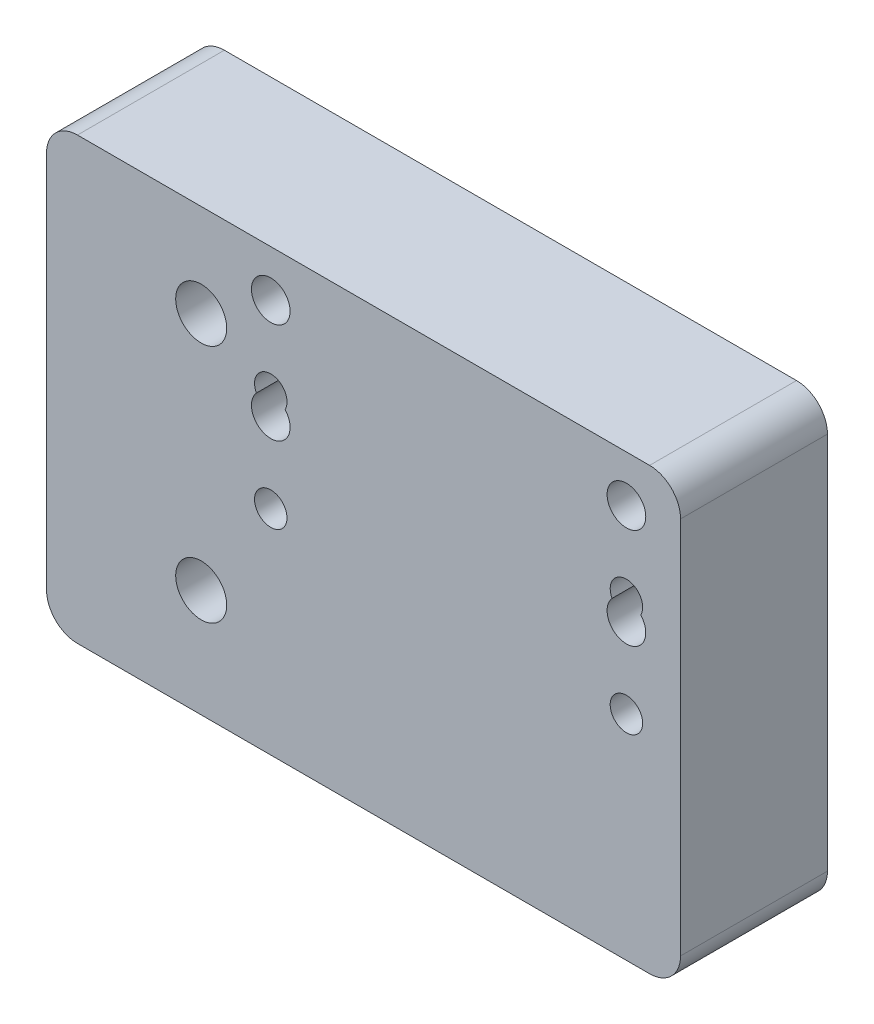
ISO-10303-21;
HEADER;
FILE_DESCRIPTION(('STEP AP214'),'2;1');
FILE_NAME('part.step','',(''),(''),'','','');
FILE_SCHEMA(('AUTOMOTIVE_DESIGN { 1 0 10303 214 1 1 1 1 }'));
ENDSEC;
DATA;
#1=APPLICATION_CONTEXT('core data for automotive mechanical design processes');
#2=APPLICATION_PROTOCOL_DEFINITION('international standard','automotive_design',2000,#1);
#3=PRODUCT_CONTEXT('',#1,'mechanical');
#4=PRODUCT('Part','Part','',(#3));
#5=PRODUCT_RELATED_PRODUCT_CATEGORY('part','',(#4));
#6=PRODUCT_DEFINITION_FORMATION('','',#4);
#7=PRODUCT_DEFINITION_CONTEXT('part definition',#1,'design');
#8=PRODUCT_DEFINITION('design','',#6,#7);
#9=PRODUCT_DEFINITION_SHAPE('','',#8);
#10=(LENGTH_UNIT() NAMED_UNIT(*) SI_UNIT(.MILLI.,.METRE.));
#11=(NAMED_UNIT(*) PLANE_ANGLE_UNIT() SI_UNIT($,.RADIAN.));
#12=(NAMED_UNIT(*) SI_UNIT($,.STERADIAN.) SOLID_ANGLE_UNIT());
#13=UNCERTAINTY_MEASURE_WITH_UNIT(LENGTH_MEASURE(1.E-05),#10,'distance_accuracy_value','');
#14=(GEOMETRIC_REPRESENTATION_CONTEXT(3) GLOBAL_UNCERTAINTY_ASSIGNED_CONTEXT((#13)) GLOBAL_UNIT_ASSIGNED_CONTEXT((#10,
#11,#12)) REPRESENTATION_CONTEXT('',''));
#15=CARTESIAN_POINT('',(0.,0.,0.));
#16=DIRECTION('',(0.,0.,1.));
#17=DIRECTION('',(1.,0.,0.));
#18=AXIS2_PLACEMENT_3D('',#15,#16,#17);
#19=CARTESIAN_POINT('',(0.,0.,0.));
#20=DIRECTION('',(0.,0.,-1.));
#21=DIRECTION('',(-1.,0.,0.));
#22=AXIS2_PLACEMENT_3D('',#19,#20,#21);
#23=PLANE('',#22);
#24=CARTESIAN_POINT('',(8.99999999813458,58.7452487765764,0.));
#25=DIRECTION('',(0.,0.,1.));
#26=DIRECTION('',(1.,0.,0.));
#27=AXIS2_PLACEMENT_3D('',#24,#25,#26);
#28=CIRCLE('',#27,2.5);
#29=CARTESIAN_POINT('',(11.4999999981346,58.7452487765764,0.));
#30=VERTEX_POINT('',#29);
#31=EDGE_CURVE('E143',#30,#30,#28,.T.);
#32=ORIENTED_EDGE('',*,*,#31,.T.);
#33=EDGE_LOOP('',(#32));
#34=FACE_BOUND('',#33,.T.);
#35=CARTESIAN_POINT('',(54.9999999981346,58.7452487765762,0.));
#36=DIRECTION('',(0.,0.,1.));
#37=DIRECTION('',(1.,0.,0.));
#38=AXIS2_PLACEMENT_3D('',#35,#36,#37);
#39=CIRCLE('',#38,2.5);
#40=CARTESIAN_POINT('',(57.4999999981346,58.7452487765762,0.));
#41=VERTEX_POINT('',#40);
#42=EDGE_CURVE('E256',#41,#41,#39,.T.);
#43=ORIENTED_EDGE('',*,*,#42,.T.);
#44=EDGE_LOOP('',(#43));
#45=FACE_BOUND('',#44,.T.);
#46=CARTESIAN_POINT('',(0.,52.7452487765018,0.));
#47=DIRECTION('',(0.,0.,-1.));
#48=DIRECTION('',(-1.,0.,0.));
#49=AXIS2_PLACEMENT_3D('',#46,#47,#48);
#50=CIRCLE('',#49,6.3);
#51=CARTESIAN_POINT('',(-6.3,52.7452487765018,0.));
#52=VERTEX_POINT('',#51);
#53=EDGE_CURVE('E244',#52,#52,#50,.T.);
#54=ORIENTED_EDGE('',*,*,#53,.F.);
#55=EDGE_LOOP('',(#54));
#56=FACE_BOUND('',#55,.T.);
#57=CARTESIAN_POINT('',(0.,21.7452487765018,0.));
#58=DIRECTION('',(0.,0.,-1.));
#59=DIRECTION('',(-1.,0.,0.));
#60=AXIS2_PLACEMENT_3D('',#57,#58,#59);
#61=CIRCLE('',#60,6.3);
#62=CARTESIAN_POINT('',(-6.3,21.7452487765018,0.));
#63=VERTEX_POINT('',#62);
#64=EDGE_CURVE('E233',#63,#63,#61,.T.);
#65=ORIENTED_EDGE('',*,*,#64,.F.);
#66=EDGE_LOOP('',(#65));
#67=FACE_BOUND('',#66,.T.);
#68=DIRECTION('',(-1.,0.,0.));
#69=VECTOR('',#68,1.);
#70=CARTESIAN_POINT('',(61.9999999981127,7.79524877651672,0.));
#71=LINE('',#70,#69);
#72=CARTESIAN_POINT('',(57.9999999981127,7.79524877651672,0.));
#73=VERTEX_POINT('',#72);
#74=CARTESIAN_POINT('',(-15.9999999999999,7.79524877651672,0.));
#75=VERTEX_POINT('',#74);
#76=EDGE_CURVE('E223',#73,#75,#71,.T.);
#77=ORIENTED_EDGE('',*,*,#76,.T.);
#78=CARTESIAN_POINT('',(-15.9999999999999,11.7952487765167,0.));
#79=DIRECTION('',(0.,0.,-1.));
#80=DIRECTION('',(-1.,0.,0.));
#81=AXIS2_PLACEMENT_3D('',#78,#79,#80);
#82=CIRCLE('',#81,4.);
#83=CARTESIAN_POINT('',(-19.9999999999999,11.7952487765167,0.));
#84=VERTEX_POINT('',#83);
#85=EDGE_CURVE('E172',#75,#84,#82,.T.);
#86=ORIENTED_EDGE('',*,*,#85,.T.);
#87=DIRECTION('',(0.,-1.,0.));
#88=VECTOR('',#87,1.);
#89=CARTESIAN_POINT('',(-19.9999999999999,68.7452487765018,0.));
#90=LINE('',#89,#88);
#91=CARTESIAN_POINT('',(-19.9999999999999,60.7452487765021,0.));
#92=VERTEX_POINT('',#91);
#93=EDGE_CURVE('E154',#92,#84,#90,.T.);
#94=ORIENTED_EDGE('',*,*,#93,.F.);
#95=CARTESIAN_POINT('',(-15.9999999999999,60.7452487765021,0.));
#96=DIRECTION('',(0.,0.,-1.));
#97=DIRECTION('',(-1.,0.,0.));
#98=AXIS2_PLACEMENT_3D('',#95,#96,#97);
#99=CIRCLE('',#98,4.);
#100=CARTESIAN_POINT('',(-15.9999999999999,64.7452487765022,0.));
#101=VERTEX_POINT('',#100);
#102=EDGE_CURVE('E168',#92,#101,#99,.T.);
#103=ORIENTED_EDGE('',*,*,#102,.T.);
#104=DIRECTION('',(-1.,0.,0.));
#105=VECTOR('',#104,1.);
#106=CARTESIAN_POINT('',(-19.9999999999999,64.7452487765022,0.));
#107=LINE('',#106,#105);
#108=CARTESIAN_POINT('',(57.9999999981127,64.7452487765022,0.));
#109=VERTEX_POINT('',#108);
#110=EDGE_CURVE('E227',#109,#101,#107,.T.);
#111=ORIENTED_EDGE('',*,*,#110,.F.);
#112=CARTESIAN_POINT('',(57.9999999981127,60.7452487765021,0.));
#113=DIRECTION('',(0.,0.,-1.));
#114=DIRECTION('',(-1.,0.,0.));
#115=AXIS2_PLACEMENT_3D('',#112,#113,#114);
#116=CIRCLE('',#115,4.);
#117=CARTESIAN_POINT('',(61.9999999981127,60.7452487765021,0.));
#118=VERTEX_POINT('',#117);
#119=EDGE_CURVE('E166',#109,#118,#116,.T.);
#120=ORIENTED_EDGE('',*,*,#119,.T.);
#121=DIRECTION('',(0.,1.,0.));
#122=VECTOR('',#121,1.);
#123=CARTESIAN_POINT('',(61.9999999981127,68.7452487765019,0.));
#124=LINE('',#123,#122);
#125=CARTESIAN_POINT('',(61.9999999981127,11.7952487765167,0.));
#126=VERTEX_POINT('',#125);
#127=EDGE_CURVE('E149',#126,#118,#124,.T.);
#128=ORIENTED_EDGE('',*,*,#127,.F.);
#129=CARTESIAN_POINT('',(57.9999999981127,11.7952487765167,0.));
#130=DIRECTION('',(0.,0.,-1.));
#131=DIRECTION('',(-1.,0.,0.));
#132=AXIS2_PLACEMENT_3D('',#129,#130,#131);
#133=CIRCLE('',#132,4.);
#134=EDGE_CURVE('E170',#126,#73,#133,.T.);
#135=ORIENTED_EDGE('',*,*,#134,.T.);
#136=EDGE_LOOP('',(#77,#86,#94,#103,#111,#120,#128,#135));
#137=FACE_BOUND('',#136,.T.);
#138=CARTESIAN_POINT('',(8.99999999811648,48.3952487774818,0.));
#139=DIRECTION('',(0.,0.,1.));
#140=DIRECTION('',(1.,0.,0.));
#141=AXIS2_PLACEMENT_3D('',#138,#139,#140);
#142=CIRCLE('',#141,2.1);
#143=CARTESIAN_POINT('',(10.8584531508509,47.4174185881896,0.));
#144=VERTEX_POINT('',#143);
#145=CARTESIAN_POINT('',(7.14154684538737,47.4174185881794,0.));
#146=VERTEX_POINT('',#145);
#147=EDGE_CURVE('E57',#144,#146,#142,.T.);
#148=ORIENTED_EDGE('',*,*,#147,.T.);
#149=CARTESIAN_POINT('',(8.99999999812373,45.7452487765023,0.));
#150=DIRECTION('',(0.,0.,1.));
#151=DIRECTION('',(1.,0.,0.));
#152=AXIS2_PLACEMENT_3D('',#149,#150,#151);
#153=CIRCLE('',#152,2.5);
#154=EDGE_CURVE('E141',#146,#144,#153,.T.);
#155=ORIENTED_EDGE('',*,*,#154,.T.);
#156=EDGE_LOOP('',(#148,#155));
#157=FACE_BOUND('',#156,.T.);
#158=CARTESIAN_POINT('',(8.99999999812887,35.3952487774845,0.));
#159=DIRECTION('',(0.,0.,1.));
#160=DIRECTION('',(1.,0.,0.));
#161=AXIS2_PLACEMENT_3D('',#158,#159,#160);
#162=CIRCLE('',#161,2.1);
#163=CARTESIAN_POINT('',(11.0999999981289,35.3952487774845,0.));
#164=VERTEX_POINT('',#163);
#165=EDGE_CURVE('E210',#164,#164,#162,.T.);
#166=ORIENTED_EDGE('',*,*,#165,.T.);
#167=EDGE_LOOP('',(#166));
#168=FACE_BOUND('',#167,.T.);
#169=CARTESIAN_POINT('',(54.9999999981288,48.3952487774845,0.));
#170=DIRECTION('',(0.,0.,1.));
#171=DIRECTION('',(1.,0.,0.));
#172=AXIS2_PLACEMENT_3D('',#169,#170,#171);
#173=CIRCLE('',#172,2.1);
#174=CARTESIAN_POINT('',(56.8584531508578,47.4174185881818,0.));
#175=VERTEX_POINT('',#174);
#176=CARTESIAN_POINT('',(53.1415468453961,47.4174185881889,0.));
#177=VERTEX_POINT('',#176);
#178=EDGE_CURVE('E49',#175,#177,#173,.T.);
#179=ORIENTED_EDGE('',*,*,#178,.T.);
#180=CARTESIAN_POINT('',(54.9999999981237,45.7452487765022,0.));
#181=DIRECTION('',(0.,0.,1.));
#182=DIRECTION('',(1.,0.,0.));
#183=AXIS2_PLACEMENT_3D('',#180,#181,#182);
#184=CIRCLE('',#183,2.5);
#185=EDGE_CURVE('E133',#177,#175,#184,.T.);
#186=ORIENTED_EDGE('',*,*,#185,.T.);
#187=EDGE_LOOP('',(#179,#186));
#188=FACE_BOUND('',#187,.T.);
#189=CARTESIAN_POINT('',(54.9999999981297,35.3952487774846,0.));
#190=DIRECTION('',(0.,0.,1.));
#191=DIRECTION('',(1.,0.,0.));
#192=AXIS2_PLACEMENT_3D('',#189,#190,#191);
#193=CIRCLE('',#192,2.1);
#194=CARTESIAN_POINT('',(57.0999999981297,35.3952487774846,0.));
#195=VERTEX_POINT('',#194);
#196=EDGE_CURVE('E286',#195,#195,#193,.T.);
#197=ORIENTED_EDGE('',*,*,#196,.T.);
#198=EDGE_LOOP('',(#197));
#199=FACE_BOUND('',#198,.T.);
#200=ADVANCED_FACE('F34',(#34,#45,#56,#67,#137,#157,#168,#188,#199),#23,.T.);
#201=CARTESIAN_POINT('',(0.,0.,19.));
#202=DIRECTION('',(0.,0.,-1.));
#203=DIRECTION('',(-1.,0.,0.));
#204=AXIS2_PLACEMENT_3D('',#201,#202,#203);
#205=PLANE('',#204);
#206=CARTESIAN_POINT('',(54.9999999981297,35.3952487774846,19.));
#207=DIRECTION('',(0.,0.,1.));
#208=DIRECTION('',(1.,0.,0.));
#209=AXIS2_PLACEMENT_3D('',#206,#207,#208);
#210=CIRCLE('',#209,2.1);
#211=CARTESIAN_POINT('',(57.0999999981297,35.3952487774846,19.));
#212=VERTEX_POINT('',#211);
#213=EDGE_CURVE('E289',#212,#212,#210,.T.);
#214=ORIENTED_EDGE('',*,*,#213,.F.);
#215=EDGE_LOOP('',(#214));
#216=FACE_BOUND('',#215,.T.);
#217=DIRECTION('',(0.,-1.,0.));
#218=VECTOR('',#217,1.);
#219=CARTESIAN_POINT('',(-19.9999999999999,68.7452487765018,19.));
#220=LINE('',#219,#218);
#221=CARTESIAN_POINT('',(-19.9999999999999,60.7452487765021,19.));
#222=VERTEX_POINT('',#221);
#223=CARTESIAN_POINT('',(-19.9999999999999,11.7952487765167,19.));
#224=VERTEX_POINT('',#223);
#225=EDGE_CURVE('E153',#222,#224,#220,.T.);
#226=ORIENTED_EDGE('',*,*,#225,.T.);
#227=CARTESIAN_POINT('',(-15.9999999999999,11.7952487765167,19.));
#228=DIRECTION('',(0.,0.,-1.));
#229=DIRECTION('',(-1.,0.,0.));
#230=AXIS2_PLACEMENT_3D('',#227,#228,#229);
#231=CIRCLE('',#230,4.);
#232=CARTESIAN_POINT('',(-15.9999999999999,7.79524877651672,19.));
#233=VERTEX_POINT('',#232);
#234=EDGE_CURVE('E185',#224,#233,#231,.F.);
#235=ORIENTED_EDGE('',*,*,#234,.T.);
#236=DIRECTION('',(-1.,0.,0.));
#237=VECTOR('',#236,1.);
#238=CARTESIAN_POINT('',(61.9999999981127,7.79524877651672,19.));
#239=LINE('',#238,#237);
#240=CARTESIAN_POINT('',(57.9999999981127,7.79524877651672,19.));
#241=VERTEX_POINT('',#240);
#242=EDGE_CURVE('E224',#241,#233,#239,.T.);
#243=ORIENTED_EDGE('',*,*,#242,.F.);
#244=CARTESIAN_POINT('',(57.9999999981127,11.7952487765167,19.));
#245=DIRECTION('',(0.,0.,-1.));
#246=DIRECTION('',(-1.,0.,0.));
#247=AXIS2_PLACEMENT_3D('',#244,#245,#246);
#248=CIRCLE('',#247,4.);
#249=CARTESIAN_POINT('',(61.9999999981127,11.7952487765167,19.));
#250=VERTEX_POINT('',#249);
#251=EDGE_CURVE('E183',#241,#250,#248,.F.);
#252=ORIENTED_EDGE('',*,*,#251,.T.);
#253=DIRECTION('',(0.,1.,0.));
#254=VECTOR('',#253,1.);
#255=CARTESIAN_POINT('',(61.9999999981127,68.7452487765019,19.));
#256=LINE('',#255,#254);
#257=CARTESIAN_POINT('',(61.9999999981127,60.7452487765021,19.));
#258=VERTEX_POINT('',#257);
#259=EDGE_CURVE('E150',#250,#258,#256,.T.);
#260=ORIENTED_EDGE('',*,*,#259,.T.);
#261=CARTESIAN_POINT('',(57.9999999981127,60.7452487765021,19.));
#262=DIRECTION('',(0.,0.,-1.));
#263=DIRECTION('',(-1.,0.,0.));
#264=AXIS2_PLACEMENT_3D('',#261,#262,#263);
#265=CIRCLE('',#264,4.);
#266=CARTESIAN_POINT('',(57.9999999981127,64.7452487765022,19.));
#267=VERTEX_POINT('',#266);
#268=EDGE_CURVE('E179',#258,#267,#265,.F.);
#269=ORIENTED_EDGE('',*,*,#268,.T.);
#270=DIRECTION('',(-1.,0.,0.));
#271=VECTOR('',#270,1.);
#272=CARTESIAN_POINT('',(-19.9999999999999,64.7452487765022,19.));
#273=LINE('',#272,#271);
#274=CARTESIAN_POINT('',(-15.9999999999999,64.7452487765022,19.));
#275=VERTEX_POINT('',#274);
#276=EDGE_CURVE('E230',#267,#275,#273,.T.);
#277=ORIENTED_EDGE('',*,*,#276,.T.);
#278=CARTESIAN_POINT('',(-15.9999999999999,60.7452487765021,19.));
#279=DIRECTION('',(0.,0.,-1.));
#280=DIRECTION('',(-1.,0.,0.));
#281=AXIS2_PLACEMENT_3D('',#278,#279,#280);
#282=CIRCLE('',#281,4.);
#283=EDGE_CURVE('E181',#275,#222,#282,.F.);
#284=ORIENTED_EDGE('',*,*,#283,.T.);
#285=EDGE_LOOP('',(#226,#235,#243,#252,#260,#269,#277,#284));
#286=FACE_BOUND('',#285,.T.);
#287=CARTESIAN_POINT('',(8.99999999812373,45.7452487765023,19.));
#288=DIRECTION('',(0.,0.,1.));
#289=DIRECTION('',(1.,0.,0.));
#290=AXIS2_PLACEMENT_3D('',#287,#288,#289);
#291=CIRCLE('',#290,2.5);
#292=CARTESIAN_POINT('',(7.14154684538737,47.4174185881794,19.));
#293=VERTEX_POINT('',#292);
#294=CARTESIAN_POINT('',(10.8584531508509,47.4174185881896,19.));
#295=VERTEX_POINT('',#294);
#296=EDGE_CURVE('E137',#293,#295,#291,.T.);
#297=ORIENTED_EDGE('',*,*,#296,.F.);
#298=CARTESIAN_POINT('',(8.99999999811648,48.3952487774818,19.));
#299=DIRECTION('',(0.,0.,1.));
#300=DIRECTION('',(1.,0.,0.));
#301=AXIS2_PLACEMENT_3D('',#298,#299,#300);
#302=CIRCLE('',#301,2.1);
#303=EDGE_CURVE('E209',#295,#293,#302,.T.);
#304=ORIENTED_EDGE('',*,*,#303,.F.);
#305=EDGE_LOOP('',(#297,#304));
#306=FACE_BOUND('',#305,.T.);
#307=CARTESIAN_POINT('',(8.99999999813458,58.7452487765764,19.));
#308=DIRECTION('',(0.,0.,1.));
#309=DIRECTION('',(1.,0.,0.));
#310=AXIS2_PLACEMENT_3D('',#307,#308,#309);
#311=CIRCLE('',#310,2.5);
#312=CARTESIAN_POINT('',(11.4999999981346,58.7452487765764,19.));
#313=VERTEX_POINT('',#312);
#314=EDGE_CURVE('E259',#313,#313,#311,.T.);
#315=ORIENTED_EDGE('',*,*,#314,.F.);
#316=EDGE_LOOP('',(#315));
#317=FACE_BOUND('',#316,.T.);
#318=CARTESIAN_POINT('',(54.9999999981346,58.7452487765762,19.));
#319=DIRECTION('',(0.,0.,1.));
#320=DIRECTION('',(1.,0.,0.));
#321=AXIS2_PLACEMENT_3D('',#318,#319,#320);
#322=CIRCLE('',#321,2.5);
#323=CARTESIAN_POINT('',(57.4999999981346,58.7452487765762,19.));
#324=VERTEX_POINT('',#323);
#325=EDGE_CURVE('E253',#324,#324,#322,.T.);
#326=ORIENTED_EDGE('',*,*,#325,.F.);
#327=EDGE_LOOP('',(#326));
#328=FACE_BOUND('',#327,.T.);
#329=CARTESIAN_POINT('',(0.,52.7452487765018,19.));
#330=DIRECTION('',(0.,0.,-1.));
#331=DIRECTION('',(-1.,0.,0.));
#332=AXIS2_PLACEMENT_3D('',#329,#330,#331);
#333=CIRCLE('',#332,3.3);
#334=CARTESIAN_POINT('',(-3.3,52.7452487765018,19.));
#335=VERTEX_POINT('',#334);
#336=EDGE_CURVE('E250',#335,#335,#333,.T.);
#337=ORIENTED_EDGE('',*,*,#336,.T.);
#338=EDGE_LOOP('',(#337));
#339=FACE_BOUND('',#338,.T.);
#340=CARTESIAN_POINT('',(0.,21.7452487765018,19.));
#341=DIRECTION('',(0.,0.,-1.));
#342=DIRECTION('',(-1.,0.,0.));
#343=AXIS2_PLACEMENT_3D('',#340,#341,#342);
#344=CIRCLE('',#343,3.3);
#345=CARTESIAN_POINT('',(-3.3,21.7452487765018,19.));
#346=VERTEX_POINT('',#345);
#347=EDGE_CURVE('E241',#346,#346,#344,.T.);
#348=ORIENTED_EDGE('',*,*,#347,.T.);
#349=EDGE_LOOP('',(#348));
#350=FACE_BOUND('',#349,.T.);
#351=CARTESIAN_POINT('',(8.99999999812887,35.3952487774845,19.));
#352=DIRECTION('',(0.,0.,1.));
#353=DIRECTION('',(1.,0.,0.));
#354=AXIS2_PLACEMENT_3D('',#351,#352,#353);
#355=CIRCLE('',#354,2.1);
#356=CARTESIAN_POINT('',(11.0999999981289,35.3952487774845,19.));
#357=VERTEX_POINT('',#356);
#358=EDGE_CURVE('E134',#357,#357,#355,.T.);
#359=ORIENTED_EDGE('',*,*,#358,.F.);
#360=EDGE_LOOP('',(#359));
#361=FACE_BOUND('',#360,.T.);
#362=CARTESIAN_POINT('',(54.9999999981288,48.3952487774845,19.));
#363=DIRECTION('',(0.,0.,1.));
#364=DIRECTION('',(1.,0.,0.));
#365=AXIS2_PLACEMENT_3D('',#362,#363,#364);
#366=CIRCLE('',#365,2.1);
#367=CARTESIAN_POINT('',(56.8584531508578,47.4174185881818,19.));
#368=VERTEX_POINT('',#367);
#369=CARTESIAN_POINT('',(53.1415468453961,47.4174185881889,19.));
#370=VERTEX_POINT('',#369);
#371=EDGE_CURVE('E125',#368,#370,#366,.T.);
#372=ORIENTED_EDGE('',*,*,#371,.F.);
#373=CARTESIAN_POINT('',(54.9999999981237,45.7452487765022,19.));
#374=DIRECTION('',(0.,0.,1.));
#375=DIRECTION('',(1.,0.,0.));
#376=AXIS2_PLACEMENT_3D('',#373,#374,#375);
#377=CIRCLE('',#376,2.5);
#378=EDGE_CURVE('E138',#370,#368,#377,.T.);
#379=ORIENTED_EDGE('',*,*,#378,.F.);
#380=EDGE_LOOP('',(#372,#379));
#381=FACE_BOUND('',#380,.T.);
#382=ADVANCED_FACE('F207',(#216,#286,#306,#317,#328,#339,#350,#361,#381),#205,.F.);
#383=CARTESIAN_POINT('',(61.9999999981127,68.7452487765019,19.));
#384=DIRECTION('',(-1.,0.,0.));
#385=DIRECTION('',(0.,-1.,0.));
#386=AXIS2_PLACEMENT_3D('',#383,#384,#385);
#387=PLANE('',#386);
#388=ORIENTED_EDGE('',*,*,#259,.F.);
#389=DIRECTION('',(0.,0.,-1.));
#390=VECTOR('',#389,1.);
#391=CARTESIAN_POINT('',(61.9999999981127,11.7952487765167,0.));
#392=LINE('',#391,#390);
#393=EDGE_CURVE('E189',#250,#126,#392,.T.);
#394=ORIENTED_EDGE('',*,*,#393,.T.);
#395=ORIENTED_EDGE('',*,*,#127,.T.);
#396=DIRECTION('',(0.,0.,-1.));
#397=VECTOR('',#396,1.);
#398=CARTESIAN_POINT('',(61.9999999981127,60.7452487765021,19.));
#399=LINE('',#398,#397);
#400=EDGE_CURVE('E187',#118,#258,#399,.F.);
#401=ORIENTED_EDGE('',*,*,#400,.T.);
#402=EDGE_LOOP('',(#388,#394,#395,#401));
#403=FACE_BOUND('',#402,.T.);
#404=ADVANCED_FACE('F274',(#403),#387,.F.);
#405=CARTESIAN_POINT('',(-19.9999999999999,68.7452487765018,19.));
#406=DIRECTION('',(1.,0.,0.));
#407=DIRECTION('',(0.,1.,0.));
#408=AXIS2_PLACEMENT_3D('',#405,#406,#407);
#409=PLANE('',#408);
#410=ORIENTED_EDGE('',*,*,#93,.T.);
#411=DIRECTION('',(0.,0.,-1.));
#412=VECTOR('',#411,1.);
#413=CARTESIAN_POINT('',(-19.9999999999999,11.7952487765167,19.));
#414=LINE('',#413,#412);
#415=EDGE_CURVE('E177',#84,#224,#414,.F.);
#416=ORIENTED_EDGE('',*,*,#415,.T.);
#417=ORIENTED_EDGE('',*,*,#225,.F.);
#418=DIRECTION('',(0.,0.,-1.));
#419=VECTOR('',#418,1.);
#420=CARTESIAN_POINT('',(-19.9999999999999,60.7452487765021,19.));
#421=LINE('',#420,#419);
#422=EDGE_CURVE('E174',#222,#92,#421,.T.);
#423=ORIENTED_EDGE('',*,*,#422,.T.);
#424=EDGE_LOOP('',(#410,#416,#417,#423));
#425=FACE_BOUND('',#424,.T.);
#426=ADVANCED_FACE('F313',(#425),#409,.F.);
#427=CARTESIAN_POINT('',(8.99999999812373,45.7452487765023,19.));
#428=DIRECTION('',(0.,0.,1.));
#429=DIRECTION('',(1.,0.,0.));
#430=AXIS2_PLACEMENT_3D('',#427,#428,#429);
#431=CYLINDRICAL_SURFACE('',#430,2.5);
#432=ORIENTED_EDGE('',*,*,#154,.F.);
#433=DIRECTION('',(0.,0.,1.));
#434=VECTOR('',#433,1.);
#435=CARTESIAN_POINT('',(7.14154684538737,47.4174185881794,9.5));
#436=LINE('',#435,#434);
#437=EDGE_CURVE('E199',#146,#293,#436,.T.);
#438=ORIENTED_EDGE('',*,*,#437,.T.);
#439=ORIENTED_EDGE('',*,*,#296,.T.);
#440=DIRECTION('',(0.,0.,1.));
#441=VECTOR('',#440,1.);
#442=CARTESIAN_POINT('',(10.8584531508509,47.4174185881896,9.5));
#443=LINE('',#442,#441);
#444=EDGE_CURVE('E197',#295,#144,#443,.F.);
#445=ORIENTED_EDGE('',*,*,#444,.T.);
#446=EDGE_LOOP('',(#432,#438,#439,#445));
#447=FACE_BOUND('',#446,.T.);
#448=ADVANCED_FACE('F204',(#447),#431,.F.);
#449=CARTESIAN_POINT('',(54.9999999981237,45.7452487765022,19.));
#450=DIRECTION('',(0.,0.,1.));
#451=DIRECTION('',(1.,0.,0.));
#452=AXIS2_PLACEMENT_3D('',#449,#450,#451);
#453=CYLINDRICAL_SURFACE('',#452,2.5);
#454=ORIENTED_EDGE('',*,*,#185,.F.);
#455=DIRECTION('',(0.,0.,1.));
#456=VECTOR('',#455,1.);
#457=CARTESIAN_POINT('',(53.1415468453961,47.4174185881889,9.5));
#458=LINE('',#457,#456);
#459=EDGE_CURVE('E11',#177,#370,#458,.T.);
#460=ORIENTED_EDGE('',*,*,#459,.T.);
#461=ORIENTED_EDGE('',*,*,#378,.T.);
#462=DIRECTION('',(0.,0.,1.));
#463=VECTOR('',#462,1.);
#464=CARTESIAN_POINT('',(56.8584531508578,47.4174185881818,9.5));
#465=LINE('',#464,#463);
#466=EDGE_CURVE('E42',#368,#175,#465,.F.);
#467=ORIENTED_EDGE('',*,*,#466,.T.);
#468=EDGE_LOOP('',(#454,#460,#461,#467));
#469=FACE_BOUND('',#468,.T.);
#470=ADVANCED_FACE('F136',(#469),#453,.F.);
#471=CARTESIAN_POINT('',(8.99999999813458,58.7452487765764,19.));
#472=DIRECTION('',(0.,0.,1.));
#473=DIRECTION('',(1.,0.,0.));
#474=AXIS2_PLACEMENT_3D('',#471,#472,#473);
#475=CYLINDRICAL_SURFACE('',#474,2.5);
#476=ORIENTED_EDGE('',*,*,#31,.F.);
#477=EDGE_LOOP('',(#476));
#478=FACE_BOUND('',#477,.T.);
#479=ORIENTED_EDGE('',*,*,#314,.T.);
#480=EDGE_LOOP('',(#479));
#481=FACE_BOUND('',#480,.T.);
#482=ADVANCED_FACE('F266',(#478,#481),#475,.F.);
#483=CARTESIAN_POINT('',(54.9999999981346,58.7452487765762,19.));
#484=DIRECTION('',(0.,0.,1.));
#485=DIRECTION('',(1.,0.,0.));
#486=AXIS2_PLACEMENT_3D('',#483,#484,#485);
#487=CYLINDRICAL_SURFACE('',#486,2.5);
#488=ORIENTED_EDGE('',*,*,#42,.F.);
#489=EDGE_LOOP('',(#488));
#490=FACE_BOUND('',#489,.T.);
#491=ORIENTED_EDGE('',*,*,#325,.T.);
#492=EDGE_LOOP('',(#491));
#493=FACE_BOUND('',#492,.T.);
#494=ADVANCED_FACE('F269',(#490,#493),#487,.F.);
#495=CARTESIAN_POINT('',(0.,52.7452487765018,0.));
#496=DIRECTION('',(0.,0.,-1.));
#497=DIRECTION('',(-1.,0.,0.));
#498=AXIS2_PLACEMENT_3D('',#495,#496,#497);
#499=CYLINDRICAL_SURFACE('',#498,3.3);
#500=ORIENTED_EDGE('',*,*,#336,.F.);
#501=EDGE_LOOP('',(#500));
#502=FACE_BOUND('',#501,.T.);
#503=CARTESIAN_POINT('',(0.,52.7452487765018,3.));
#504=DIRECTION('',(0.,0.,-1.));
#505=DIRECTION('',(-1.,0.,0.));
#506=AXIS2_PLACEMENT_3D('',#503,#504,#505);
#507=CIRCLE('',#506,3.3);
#508=CARTESIAN_POINT('',(-3.3,52.7452487765018,3.));
#509=VERTEX_POINT('',#508);
#510=EDGE_CURVE('E247',#509,#509,#507,.T.);
#511=ORIENTED_EDGE('',*,*,#510,.T.);
#512=EDGE_LOOP('',(#511));
#513=FACE_BOUND('',#512,.T.);
#514=ADVANCED_FACE('F383',(#502,#513),#499,.F.);
#515=CARTESIAN_POINT('',(0.,52.7452487765018,0.));
#516=DIRECTION('',(0.,0.,-1.));
#517=DIRECTION('',(-1.,0.,0.));
#518=AXIS2_PLACEMENT_3D('',#515,#516,#517);
#519=CONICAL_SURFACE('',#518,6.3,0.785398163397448);
#520=ORIENTED_EDGE('',*,*,#510,.F.);
#521=EDGE_LOOP('',(#520));
#522=FACE_BOUND('',#521,.T.);
#523=ORIENTED_EDGE('',*,*,#53,.T.);
#524=EDGE_LOOP('',(#523));
#525=FACE_BOUND('',#524,.T.);
#526=ADVANCED_FACE('F379',(#522,#525),#519,.F.);
#527=CARTESIAN_POINT('',(0.,21.7452487765018,0.));
#528=DIRECTION('',(0.,0.,-1.));
#529=DIRECTION('',(-1.,0.,0.));
#530=AXIS2_PLACEMENT_3D('',#527,#528,#529);
#531=CYLINDRICAL_SURFACE('',#530,3.3);
#532=ORIENTED_EDGE('',*,*,#347,.F.);
#533=EDGE_LOOP('',(#532));
#534=FACE_BOUND('',#533,.T.);
#535=CARTESIAN_POINT('',(0.,21.7452487765018,3.));
#536=DIRECTION('',(0.,0.,-1.));
#537=DIRECTION('',(-1.,0.,0.));
#538=AXIS2_PLACEMENT_3D('',#535,#536,#537);
#539=CIRCLE('',#538,3.3);
#540=CARTESIAN_POINT('',(-3.3,21.7452487765018,3.));
#541=VERTEX_POINT('',#540);
#542=EDGE_CURVE('E238',#541,#541,#539,.T.);
#543=ORIENTED_EDGE('',*,*,#542,.T.);
#544=EDGE_LOOP('',(#543));
#545=FACE_BOUND('',#544,.T.);
#546=ADVANCED_FACE('F372',(#534,#545),#531,.F.);
#547=CARTESIAN_POINT('',(0.,21.7452487765018,0.));
#548=DIRECTION('',(0.,0.,-1.));
#549=DIRECTION('',(-1.,0.,0.));
#550=AXIS2_PLACEMENT_3D('',#547,#548,#549);
#551=CONICAL_SURFACE('',#550,6.3,0.785398163397448);
#552=ORIENTED_EDGE('',*,*,#542,.F.);
#553=EDGE_LOOP('',(#552));
#554=FACE_BOUND('',#553,.T.);
#555=ORIENTED_EDGE('',*,*,#64,.T.);
#556=EDGE_LOOP('',(#555));
#557=FACE_BOUND('',#556,.T.);
#558=ADVANCED_FACE('F364',(#554,#557),#551,.F.);
#559=CARTESIAN_POINT('',(-19.9999999999999,64.7452487765022,19.));
#560=DIRECTION('',(0.,-1.,0.));
#561=DIRECTION('',(0.,0.,-1.));
#562=AXIS2_PLACEMENT_3D('',#559,#560,#561);
#563=PLANE('',#562);
#564=ORIENTED_EDGE('',*,*,#110,.T.);
#565=DIRECTION('',(0.,0.,-1.));
#566=VECTOR('',#565,1.);
#567=CARTESIAN_POINT('',(-15.9999999999999,64.7452487765022,19.));
#568=LINE('',#567,#566);
#569=EDGE_CURVE('E195',#101,#275,#568,.F.);
#570=ORIENTED_EDGE('',*,*,#569,.T.);
#571=ORIENTED_EDGE('',*,*,#276,.F.);
#572=DIRECTION('',(0.,0.,-1.));
#573=VECTOR('',#572,1.);
#574=CARTESIAN_POINT('',(57.9999999981127,64.7452487765022,19.));
#575=LINE('',#574,#573);
#576=EDGE_CURVE('E192',#267,#109,#575,.T.);
#577=ORIENTED_EDGE('',*,*,#576,.T.);
#578=EDGE_LOOP('',(#564,#570,#571,#577));
#579=FACE_BOUND('',#578,.T.);
#580=ADVANCED_FACE('F358',(#579),#563,.F.);
#581=CARTESIAN_POINT('',(61.9999999981127,7.79524877651672,19.));
#582=DIRECTION('',(0.,-1.,0.));
#583=DIRECTION('',(0.,0.,-1.));
#584=AXIS2_PLACEMENT_3D('',#581,#582,#583);
#585=PLANE('',#584);
#586=CARTESIAN_POINT('',(41.9999999981004,7.79524877651672,9.4999999981088));
#587=DIRECTION('',(0.,-1.,0.));
#588=DIRECTION('',(0.,0.,-1.));
#589=AXIS2_PLACEMENT_3D('',#586,#587,#588);
#590=CIRCLE('',#589,2.09999999999999);
#591=CARTESIAN_POINT('',(41.9999999981004,7.79524877651672,7.39999999810881));
#592=VERTEX_POINT('',#591);
#593=EDGE_CURVE('E212',#592,#592,#590,.T.);
#594=ORIENTED_EDGE('',*,*,#593,.F.);
#595=EDGE_LOOP('',(#594));
#596=FACE_BOUND('',#595,.T.);
#597=ORIENTED_EDGE('',*,*,#242,.T.);
#598=DIRECTION('',(0.,0.,-1.));
#599=VECTOR('',#598,1.);
#600=CARTESIAN_POINT('',(-15.9999999999999,7.79524877651672,0.));
#601=LINE('',#600,#599);
#602=EDGE_CURVE('E163',#233,#75,#601,.T.);
#603=ORIENTED_EDGE('',*,*,#602,.T.);
#604=ORIENTED_EDGE('',*,*,#76,.F.);
#605=DIRECTION('',(0.,0.,-1.));
#606=VECTOR('',#605,1.);
#607=CARTESIAN_POINT('',(57.9999999981127,7.79524877651672,19.));
#608=LINE('',#607,#606);
#609=EDGE_CURVE('E157',#73,#241,#608,.F.);
#610=ORIENTED_EDGE('',*,*,#609,.T.);
#611=EDGE_LOOP('',(#597,#603,#604,#610));
#612=FACE_BOUND('',#611,.T.);
#613=ADVANCED_FACE('F324',(#596,#612),#585,.T.);
#614=CARTESIAN_POINT('',(-15.9999999999999,11.7952487765167,19.));
#615=DIRECTION('',(0.,0.,1.));
#616=DIRECTION('',(1.,0.,0.));
#617=AXIS2_PLACEMENT_3D('',#614,#615,#616);
#618=CYLINDRICAL_SURFACE('',#617,4.);
#619=ORIENTED_EDGE('',*,*,#234,.F.);
#620=ORIENTED_EDGE('',*,*,#415,.F.);
#621=ORIENTED_EDGE('',*,*,#85,.F.);
#622=ORIENTED_EDGE('',*,*,#602,.F.);
#623=EDGE_LOOP('',(#619,#620,#621,#622));
#624=FACE_BOUND('',#623,.T.);
#625=ADVANCED_FACE('F320',(#624),#618,.T.);
#626=CARTESIAN_POINT('',(57.9999999981127,11.7952487765167,19.));
#627=DIRECTION('',(0.,0.,1.));
#628=DIRECTION('',(1.,0.,0.));
#629=AXIS2_PLACEMENT_3D('',#626,#627,#628);
#630=CYLINDRICAL_SURFACE('',#629,4.);
#631=ORIENTED_EDGE('',*,*,#251,.F.);
#632=ORIENTED_EDGE('',*,*,#609,.F.);
#633=ORIENTED_EDGE('',*,*,#134,.F.);
#634=ORIENTED_EDGE('',*,*,#393,.F.);
#635=EDGE_LOOP('',(#631,#632,#633,#634));
#636=FACE_BOUND('',#635,.T.);
#637=ADVANCED_FACE('F323',(#636),#630,.T.);
#638=CARTESIAN_POINT('',(-15.9999999999999,60.7452487765021,19.));
#639=DIRECTION('',(0.,0.,-1.));
#640=DIRECTION('',(-1.,0.,0.));
#641=AXIS2_PLACEMENT_3D('',#638,#639,#640);
#642=CYLINDRICAL_SURFACE('',#641,4.);
#643=ORIENTED_EDGE('',*,*,#283,.F.);
#644=ORIENTED_EDGE('',*,*,#569,.F.);
#645=ORIENTED_EDGE('',*,*,#102,.F.);
#646=ORIENTED_EDGE('',*,*,#422,.F.);
#647=EDGE_LOOP('',(#643,#644,#645,#646));
#648=FACE_BOUND('',#647,.T.);
#649=ADVANCED_FACE('F327',(#648),#642,.T.);
#650=CARTESIAN_POINT('',(57.9999999981127,60.7452487765021,19.));
#651=DIRECTION('',(0.,0.,-1.));
#652=DIRECTION('',(-1.,0.,0.));
#653=AXIS2_PLACEMENT_3D('',#650,#651,#652);
#654=CYLINDRICAL_SURFACE('',#653,4.);
#655=ORIENTED_EDGE('',*,*,#268,.F.);
#656=ORIENTED_EDGE('',*,*,#400,.F.);
#657=ORIENTED_EDGE('',*,*,#119,.F.);
#658=ORIENTED_EDGE('',*,*,#576,.F.);
#659=EDGE_LOOP('',(#655,#656,#657,#658));
#660=FACE_BOUND('',#659,.T.);
#661=ADVANCED_FACE('F36',(#660),#654,.T.);
#662=CARTESIAN_POINT('',(41.9999999981004,37.7952487765167,9.4999999981088));
#663=DIRECTION('',(0.,-1.,0.));
#664=DIRECTION('',(0.,0.,-1.));
#665=AXIS2_PLACEMENT_3D('',#662,#663,#664);
#666=CONICAL_SURFACE('',#665,2.09999999999999,1.02974425867665);
#667=CARTESIAN_POINT('',(41.9999999981004,39.0570560764746,9.4999999981088));
#668=VERTEX_POINT('',#667);
#669=VERTEX_LOOP('',#668);
#670=FACE_BOUND('',#669,.T.);
#671=CARTESIAN_POINT('',(41.9999999981004,37.7952487765167,9.4999999981088));
#672=DIRECTION('',(0.,-1.,0.));
#673=DIRECTION('',(0.,0.,-1.));
#674=AXIS2_PLACEMENT_3D('',#671,#672,#673);
#675=CIRCLE('',#674,2.09999999999999);
#676=CARTESIAN_POINT('',(41.9999999981004,37.7952487765167,7.39999999810881));
#677=VERTEX_POINT('',#676);
#678=EDGE_CURVE('E220',#677,#677,#675,.T.);
#679=ORIENTED_EDGE('',*,*,#678,.T.);
#680=EDGE_LOOP('',(#679));
#681=FACE_BOUND('',#680,.T.);
#682=ADVANCED_FACE('F334',(#670,#681),#666,.F.);
#683=CARTESIAN_POINT('',(41.9999999981004,7.79524877651672,9.4999999981088));
#684=DIRECTION('',(0.,-1.,0.));
#685=DIRECTION('',(0.,0.,-1.));
#686=AXIS2_PLACEMENT_3D('',#683,#684,#685);
#687=CYLINDRICAL_SURFACE('',#686,2.09999999999999);
#688=ORIENTED_EDGE('',*,*,#678,.F.);
#689=EDGE_LOOP('',(#688));
#690=FACE_BOUND('',#689,.T.);
#691=ORIENTED_EDGE('',*,*,#593,.T.);
#692=EDGE_LOOP('',(#691));
#693=FACE_BOUND('',#692,.T.);
#694=ADVANCED_FACE('F304',(#690,#693),#687,.F.);
#695=CARTESIAN_POINT('',(8.99999999811648,48.3952487774818,19.));
#696=DIRECTION('',(0.,0.,1.));
#697=DIRECTION('',(1.,0.,0.));
#698=AXIS2_PLACEMENT_3D('',#695,#696,#697);
#699=CYLINDRICAL_SURFACE('',#698,2.1);
#700=ORIENTED_EDGE('',*,*,#147,.F.);
#701=ORIENTED_EDGE('',*,*,#444,.F.);
#702=ORIENTED_EDGE('',*,*,#303,.T.);
#703=ORIENTED_EDGE('',*,*,#437,.F.);
#704=EDGE_LOOP('',(#700,#701,#702,#703));
#705=FACE_BOUND('',#704,.T.);
#706=ADVANCED_FACE('F295',(#705),#699,.F.);
#707=CARTESIAN_POINT('',(8.99999999812887,35.3952487774845,19.));
#708=DIRECTION('',(0.,0.,1.));
#709=DIRECTION('',(1.,0.,0.));
#710=AXIS2_PLACEMENT_3D('',#707,#708,#709);
#711=CYLINDRICAL_SURFACE('',#710,2.1);
#712=ORIENTED_EDGE('',*,*,#165,.F.);
#713=EDGE_LOOP('',(#712));
#714=FACE_BOUND('',#713,.T.);
#715=ORIENTED_EDGE('',*,*,#358,.T.);
#716=EDGE_LOOP('',(#715));
#717=FACE_BOUND('',#716,.T.);
#718=ADVANCED_FACE('F293',(#714,#717),#711,.F.);
#719=CARTESIAN_POINT('',(54.9999999981288,48.3952487774845,19.));
#720=DIRECTION('',(0.,0.,1.));
#721=DIRECTION('',(1.,0.,0.));
#722=AXIS2_PLACEMENT_3D('',#719,#720,#721);
#723=CYLINDRICAL_SURFACE('',#722,2.1);
#724=ORIENTED_EDGE('',*,*,#178,.F.);
#725=ORIENTED_EDGE('',*,*,#466,.F.);
#726=ORIENTED_EDGE('',*,*,#371,.T.);
#727=ORIENTED_EDGE('',*,*,#459,.F.);
#728=EDGE_LOOP('',(#724,#725,#726,#727));
#729=FACE_BOUND('',#728,.T.);
#730=ADVANCED_FACE('F123',(#729),#723,.F.);
#731=CARTESIAN_POINT('',(54.9999999981297,35.3952487774846,19.));
#732=DIRECTION('',(0.,0.,1.));
#733=DIRECTION('',(1.,0.,0.));
#734=AXIS2_PLACEMENT_3D('',#731,#732,#733);
#735=CYLINDRICAL_SURFACE('',#734,2.1);
#736=ORIENTED_EDGE('',*,*,#196,.F.);
#737=EDGE_LOOP('',(#736));
#738=FACE_BOUND('',#737,.T.);
#739=ORIENTED_EDGE('',*,*,#213,.T.);
#740=EDGE_LOOP('',(#739));
#741=FACE_BOUND('',#740,.T.);
#742=ADVANCED_FACE('F302',(#738,#741),#735,.F.);
#743=CLOSED_SHELL('',(#200,#382,#404,#426,#448,#470,#482,#494,#514,#526,#546,#558,#580,#613,
#625,#637,#649,#661,#682,#694,#706,#718,#730,#742));
#744=MANIFOLD_SOLID_BREP('B2',#743);
#745=ADVANCED_BREP_SHAPE_REPRESENTATION('',(#18,#744),#14);
#746=SHAPE_DEFINITION_REPRESENTATION(#9,#745);
ENDSEC;
END-ISO-10303-21;
